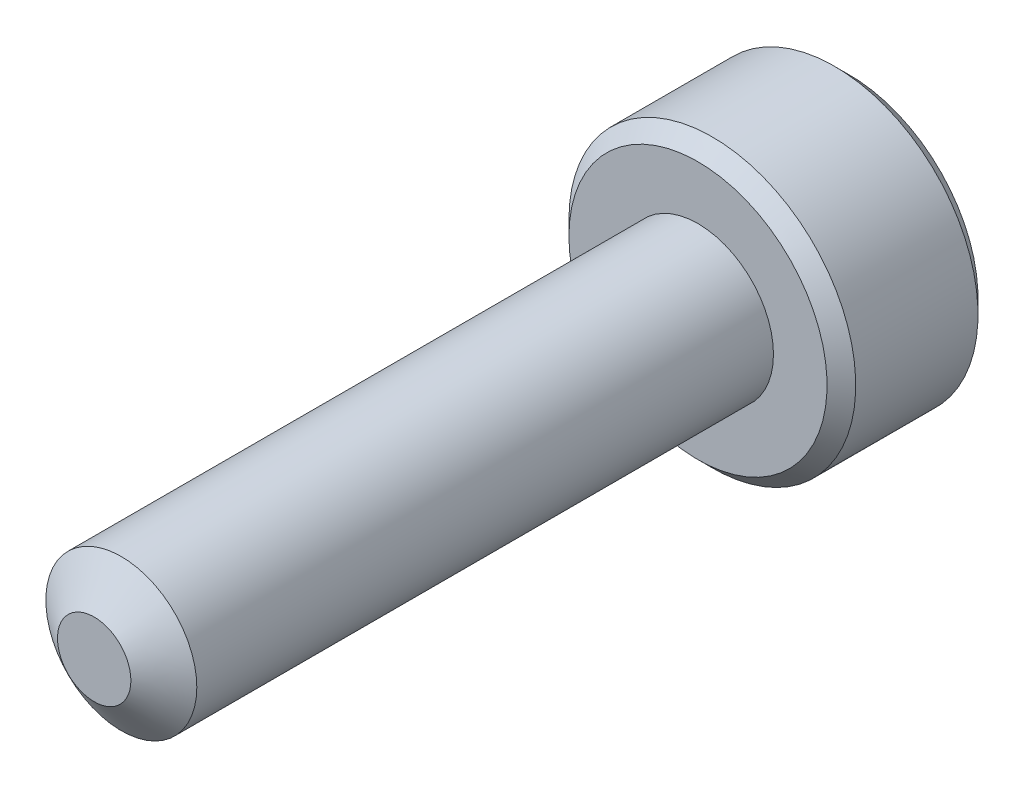
ISO-10303-21;
HEADER;
FILE_DESCRIPTION(('STEP AP214'),'2;1');
FILE_NAME('part.step','',(''),(''),'','','');
FILE_SCHEMA(('AUTOMOTIVE_DESIGN { 1 0 10303 214 1 1 1 1 }'));
ENDSEC;
DATA;
#1=APPLICATION_CONTEXT('core data for automotive mechanical design processes');
#2=APPLICATION_PROTOCOL_DEFINITION('international standard','automotive_design',2000,#1);
#3=PRODUCT_CONTEXT('',#1,'mechanical');
#4=PRODUCT('Part','Part','',(#3));
#5=PRODUCT_RELATED_PRODUCT_CATEGORY('part','',(#4));
#6=PRODUCT_DEFINITION_FORMATION('','',#4);
#7=PRODUCT_DEFINITION_CONTEXT('part definition',#1,'design');
#8=PRODUCT_DEFINITION('design','',#6,#7);
#9=PRODUCT_DEFINITION_SHAPE('','',#8);
#10=(LENGTH_UNIT() NAMED_UNIT(*) SI_UNIT(.MILLI.,.METRE.));
#11=(NAMED_UNIT(*) PLANE_ANGLE_UNIT() SI_UNIT($,.RADIAN.));
#12=(NAMED_UNIT(*) SI_UNIT($,.STERADIAN.) SOLID_ANGLE_UNIT());
#13=UNCERTAINTY_MEASURE_WITH_UNIT(LENGTH_MEASURE(1.E-05),#10,'distance_accuracy_value','');
#14=(GEOMETRIC_REPRESENTATION_CONTEXT(3) GLOBAL_UNCERTAINTY_ASSIGNED_CONTEXT((#13)) GLOBAL_UNIT_ASSIGNED_CONTEXT((#10,
#11,#12)) REPRESENTATION_CONTEXT('',''));
#15=CARTESIAN_POINT('',(0.,0.,0.));
#16=DIRECTION('',(0.,0.,1.));
#17=DIRECTION('',(1.,0.,0.));
#18=AXIS2_PLACEMENT_3D('',#15,#16,#17);
#19=CARTESIAN_POINT('',(0.,0.,-8.));
#20=DIRECTION('',(0.,0.,1.));
#21=DIRECTION('',(1.,0.,0.));
#22=AXIS2_PLACEMENT_3D('',#19,#20,#21);
#23=CYLINDRICAL_SURFACE('',#22,1.);
#24=CARTESIAN_POINT('',(0.,0.,-8.));
#25=DIRECTION('',(0.,0.,-1.));
#26=DIRECTION('',(-1.,0.,0.));
#27=AXIS2_PLACEMENT_3D('',#24,#25,#26);
#28=CIRCLE('',#27,1.);
#29=CARTESIAN_POINT('',(-1.,0.,-8.));
#30=VERTEX_POINT('',#29);
#31=EDGE_CURVE('E210',#30,#30,#28,.F.);
#32=ORIENTED_EDGE('',*,*,#31,.T.);
#33=EDGE_LOOP('',(#32));
#34=FACE_BOUND('',#33,.T.);
#35=CARTESIAN_POINT('',(0.,0.,-0.359771969508557));
#36=DIRECTION('',(0.,0.,1.));
#37=DIRECTION('',(1.,0.,0.));
#38=AXIS2_PLACEMENT_3D('',#35,#36,#37);
#39=CIRCLE('',#38,1.);
#40=CARTESIAN_POINT('',(1.,0.,-0.359771969508557));
#41=VERTEX_POINT('',#40);
#42=EDGE_CURVE('E107',#41,#41,#39,.T.);
#43=ORIENTED_EDGE('',*,*,#42,.F.);
#44=EDGE_LOOP('',(#43));
#45=FACE_BOUND('',#44,.T.);
#46=ADVANCED_FACE('F33',(#34,#45),#23,.T.);
#47=CARTESIAN_POINT('',(0.,0.,0.));
#48=DIRECTION('',(0.,0.,-1.));
#49=DIRECTION('',(-1.,0.,0.));
#50=AXIS2_PLACEMENT_3D('',#47,#48,#49);
#51=CONICAL_SURFACE('',#50,0.486192378864667,0.959931088596884);
#52=ORIENTED_EDGE('',*,*,#42,.T.);
#53=EDGE_LOOP('',(#52));
#54=FACE_BOUND('',#53,.T.);
#55=CARTESIAN_POINT('',(0.,0.,0.));
#56=DIRECTION('',(0.,0.,1.));
#57=DIRECTION('',(1.,0.,0.));
#58=AXIS2_PLACEMENT_3D('',#55,#56,#57);
#59=CIRCLE('',#58,0.486192378864667);
#60=CARTESIAN_POINT('',(0.486192378864667,0.,0.));
#61=VERTEX_POINT('',#60);
#62=EDGE_CURVE('E208',#61,#61,#59,.T.);
#63=ORIENTED_EDGE('',*,*,#62,.F.);
#64=EDGE_LOOP('',(#63));
#65=FACE_BOUND('',#64,.T.);
#66=ADVANCED_FACE('F191',(#54,#65),#51,.T.);
#67=CARTESIAN_POINT('',(0.,0.,0.));
#68=DIRECTION('',(0.,0.,1.));
#69=DIRECTION('',(1.,0.,0.));
#70=AXIS2_PLACEMENT_3D('',#67,#68,#69);
#71=PLANE('',#70);
#72=ORIENTED_EDGE('',*,*,#62,.T.);
#73=EDGE_LOOP('',(#72));
#74=FACE_BOUND('',#73,.T.);
#75=ADVANCED_FACE('F188',(#74),#71,.T.);
#76=CARTESIAN_POINT('',(0.,0.,-10.));
#77=DIRECTION('',(0.,0.,1.));
#78=DIRECTION('',(1.,0.,0.));
#79=AXIS2_PLACEMENT_3D('',#76,#77,#78);
#80=CYLINDRICAL_SURFACE('',#79,1.9);
#81=CARTESIAN_POINT('',(0.,0.,-9.81));
#82=DIRECTION('',(0.,0.,-1.));
#83=DIRECTION('',(-1.,0.,0.));
#84=AXIS2_PLACEMENT_3D('',#81,#82,#83);
#85=CIRCLE('',#84,1.9);
#86=CARTESIAN_POINT('',(-1.9,0.,-9.81));
#87=VERTEX_POINT('',#86);
#88=EDGE_CURVE('E41',#87,#87,#85,.F.);
#89=ORIENTED_EDGE('',*,*,#88,.T.);
#90=EDGE_LOOP('',(#89));
#91=FACE_BOUND('',#90,.T.);
#92=CARTESIAN_POINT('',(0.,0.,-8.19));
#93=DIRECTION('',(0.,0.,-1.));
#94=DIRECTION('',(-1.,0.,0.));
#95=AXIS2_PLACEMENT_3D('',#92,#93,#94);
#96=CIRCLE('',#95,1.9);
#97=CARTESIAN_POINT('',(-1.9,0.,-8.19));
#98=VERTEX_POINT('',#97);
#99=EDGE_CURVE('E167',#98,#98,#96,.T.);
#100=ORIENTED_EDGE('',*,*,#99,.T.);
#101=EDGE_LOOP('',(#100));
#102=FACE_BOUND('',#101,.T.);
#103=ADVANCED_FACE('F172',(#91,#102),#80,.T.);
#104=CARTESIAN_POINT('',(0.,0.,-10.));
#105=DIRECTION('',(0.,0.,-1.));
#106=DIRECTION('',(-1.,0.,0.));
#107=AXIS2_PLACEMENT_3D('',#104,#105,#106);
#108=PLANE('',#107);
#109=CARTESIAN_POINT('',(0.,0.,-10.));
#110=DIRECTION('',(0.,0.,-1.));
#111=DIRECTION('',(-1.,0.,0.));
#112=AXIS2_PLACEMENT_3D('',#109,#110,#111);
#113=CIRCLE('',#112,1.71);
#114=CARTESIAN_POINT('',(-1.71,0.,-10.));
#115=VERTEX_POINT('',#114);
#116=EDGE_CURVE('E106',#115,#115,#113,.T.);
#117=ORIENTED_EDGE('',*,*,#116,.T.);
#118=EDGE_LOOP('',(#117));
#119=FACE_BOUND('',#118,.T.);
#120=CARTESIAN_POINT('',(0.,0.,-10.));
#121=DIRECTION('',(0.,0.,-1.));
#122=DIRECTION('',(-1.,0.,0.));
#123=AXIS2_PLACEMENT_3D('',#120,#121,#122);
#124=CIRCLE('',#123,0.866025403784438);
#125=CARTESIAN_POINT('',(-0.749999999999999,0.43301270189222,-10.));
#126=VERTEX_POINT('',#125);
#127=CARTESIAN_POINT('',(0.,0.866025403784438,-10.));
#128=VERTEX_POINT('',#127);
#129=EDGE_CURVE('E87',#126,#128,#124,.T.);
#130=ORIENTED_EDGE('',*,*,#129,.F.);
#131=CARTESIAN_POINT('',(-0.749999999999999,-0.43301270189222,-10.));
#132=VERTEX_POINT('',#131);
#133=EDGE_CURVE('E47',#132,#126,#124,.T.);
#134=ORIENTED_EDGE('',*,*,#133,.F.);
#135=CARTESIAN_POINT('',(0.,-0.866025403784438,-10.));
#136=VERTEX_POINT('',#135);
#137=EDGE_CURVE('E266',#136,#132,#124,.T.);
#138=ORIENTED_EDGE('',*,*,#137,.F.);
#139=CARTESIAN_POINT('',(0.75,-0.433012701892219,-10.));
#140=VERTEX_POINT('',#139);
#141=EDGE_CURVE('E54',#140,#136,#124,.T.);
#142=ORIENTED_EDGE('',*,*,#141,.F.);
#143=CARTESIAN_POINT('',(0.749999999999999,0.43301270189222,-10.));
#144=VERTEX_POINT('',#143);
#145=EDGE_CURVE('E128',#144,#140,#124,.T.);
#146=ORIENTED_EDGE('',*,*,#145,.F.);
#147=EDGE_CURVE('E96',#128,#144,#124,.T.);
#148=ORIENTED_EDGE('',*,*,#147,.F.);
#149=EDGE_LOOP('',(#130,#134,#138,#142,#146,#148));
#150=FACE_BOUND('',#149,.T.);
#151=ADVANCED_FACE('F127',(#119,#150),#108,.T.);
#152=CARTESIAN_POINT('',(0.,0.,-8.));
#153=DIRECTION('',(0.,0.,-1.));
#154=DIRECTION('',(-1.,0.,0.));
#155=AXIS2_PLACEMENT_3D('',#152,#153,#154);
#156=PLANE('',#155);
#157=CARTESIAN_POINT('',(0.,0.,-8.));
#158=DIRECTION('',(0.,0.,-1.));
#159=DIRECTION('',(-1.,0.,0.));
#160=AXIS2_PLACEMENT_3D('',#157,#158,#159);
#161=CIRCLE('',#160,1.71);
#162=CARTESIAN_POINT('',(-1.71,0.,-8.));
#163=VERTEX_POINT('',#162);
#164=EDGE_CURVE('E11',#163,#163,#161,.F.);
#165=ORIENTED_EDGE('',*,*,#164,.T.);
#166=EDGE_LOOP('',(#165));
#167=FACE_BOUND('',#166,.T.);
#168=ORIENTED_EDGE('',*,*,#31,.F.);
#169=EDGE_LOOP('',(#168));
#170=FACE_BOUND('',#169,.T.);
#171=ADVANCED_FACE('F181',(#167,#170),#156,.F.);
#172=CARTESIAN_POINT('',(0.,0.,-10.));
#173=DIRECTION('',(0.,0.,-1.));
#174=DIRECTION('',(-1.,0.,0.));
#175=AXIS2_PLACEMENT_3D('',#172,#173,#174);
#176=CONICAL_SURFACE('',#175,0.866025403784438,0.78539816339745);
#177=ORIENTED_EDGE('',*,*,#147,.T.);
#178=CARTESIAN_POINT('',(-0.000199999999999593,0.866140873838276,-10.0001154931448));
#179=CARTESIAN_POINT('',(0.025589962557682,0.851251032013208,-9.98523411046392));
#180=CARTESIAN_POINT('',(0.0518112021286597,0.836112192288419,-9.97122626560696));
#181=CARTESIAN_POINT('',(0.105279708235707,0.805242135894348,-9.94557752468226));
#182=CARTESIAN_POINT('',(0.132532067460573,0.789507978959819,-9.93395091170567));
#183=CARTESIAN_POINT('',(0.187485350381353,0.757780686272653,-9.91403404577224));
#184=CARTESIAN_POINT('',(0.21517225669551,0.741795643459147,-9.90569369408137));
#185=CARTESIAN_POINT('',(0.271155595130853,0.709473647943367,-9.89284274196143));
#186=CARTESIAN_POINT('',(0.299450314843645,0.693137683900542,-9.88832254058884));
#187=CARTESIAN_POINT('',(0.348210289268843,0.664986099540475,-9.88424583309744));
#188=CARTESIAN_POINT('',(0.368612065655572,0.65320712845165,-9.88364279661408));
#189=CARTESIAN_POINT('',(0.40937613469636,0.629671982217687,-9.88465450601553));
#190=CARTESIAN_POINT('',(0.429738417651455,0.617915812672247,-9.88626974099003));
#191=CARTESIAN_POINT('',(0.490534543086824,0.582815153286451,-9.89433614697304));
#192=CARTESIAN_POINT('',(0.530665854996099,0.559645329552698,-9.90400893582772));
#193=CARTESIAN_POINT('',(0.601110400354026,0.518974152327358,-9.92735631797231));
#194=CARTESIAN_POINT('',(0.631753572009086,0.501282308923485,-9.93980855807225));
#195=CARTESIAN_POINT('',(0.691839345804789,0.466591771248069,-9.96785961023086));
#196=CARTESIAN_POINT('',(0.72128548838159,0.449591032904757,-9.98344818590375));
#197=CARTESIAN_POINT('',(0.7502,0.432897231838382,-10.0001154931448));
#198=B_SPLINE_CURVE_WITH_KNOTS('',3,(#178,#179,#180,#181,#182,#183,#184,#185,#186,#187,#188,
#189,#190,#191,#192,#193,#194,#195,#196,#197),.UNSPECIFIED.,.F.,.F.,(4,2,2,2,2,2,2,2,2,4),(0.,
0.0999419466095601,0.200466857654446,0.299393763705717,0.39807129730023,0.468665775681747,
0.539275821398839,0.680536257244566,0.792918418368073,0.904939568716031),.UNSPECIFIED.);
#199=EDGE_CURVE('E101',#128,#144,#198,.T.);
#200=ORIENTED_EDGE('',*,*,#199,.F.);
#201=EDGE_LOOP('',(#177,#200));
#202=FACE_BOUND('',#201,.T.);
#203=ADVANCED_FACE('F102',(#202),#176,.F.);
#204=ORIENTED_EDGE('',*,*,#145,.T.);
#205=CARTESIAN_POINT('',(0.75,-0.863604064974112,-10.2777892582303));
#206=CARTESIAN_POINT('',(0.75,-0.842575879856458,-10.2619149320996));
#207=CARTESIAN_POINT('',(0.75,-0.82143049641015,-10.2461962652706));
#208=CARTESIAN_POINT('',(0.75,-0.7788578575305,-10.2151345207069));
#209=CARTESIAN_POINT('',(0.75,-0.757430533150144,-10.1997915375702));
#210=CARTESIAN_POINT('',(0.75,-0.69234071080991,-10.1542035803594));
#211=CARTESIAN_POINT('',(0.75,-0.648190081142954,-10.1246440918019));
#212=CARTESIAN_POINT('',(0.75,-0.555607181575076,-10.0666155827363));
#213=CARTESIAN_POINT('',(0.75,-0.507074363082498,-10.0383051094017));
#214=CARTESIAN_POINT('',(0.75,-0.407587529818442,-9.98651811179061));
#215=CARTESIAN_POINT('',(0.75,-0.356642419585008,-9.96302529154705));
#216=CARTESIAN_POINT('',(0.75,-0.280165468850111,-9.93428689951103));
#217=CARTESIAN_POINT('',(0.75,-0.255770023962927,-9.9260392748236));
#218=CARTESIAN_POINT('',(0.75,-0.206403277923611,-9.91149717543051));
#219=CARTESIAN_POINT('',(0.75,-0.181431937227496,-9.90520283527902));
#220=CARTESIAN_POINT('',(0.75,-0.10669987945563,-9.88999317388815));
#221=CARTESIAN_POINT('',(0.75,-0.0561907172329782,-9.88437718471751));
#222=CARTESIAN_POINT('',(0.75,0.0430767231074191,-9.88362825645083));
#223=CARTESIAN_POINT('',(0.75,0.0918322433444378,-9.88812345139702));
#224=CARTESIAN_POINT('',(0.75,0.164112195619626,-9.90133730742922));
#225=CARTESIAN_POINT('',(0.75,0.188278676798617,-9.90690144636243));
#226=CARTESIAN_POINT('',(0.75,0.236094480035413,-9.91992316612325));
#227=CARTESIAN_POINT('',(0.75,0.259743845186176,-9.92738058851924));
#228=CARTESIAN_POINT('',(0.75,0.334198278358037,-9.95366646942379));
#229=CARTESIAN_POINT('',(0.75,0.383940060323694,-9.97549033799338));
#230=CARTESIAN_POINT('',(0.75,0.481089224924055,-10.0240118040186));
#231=CARTESIAN_POINT('',(0.75,0.528487417805623,-10.0507269112141));
#232=CARTESIAN_POINT('',(0.75,0.619071540271279,-10.1058428510274));
#233=CARTESIAN_POINT('',(0.75,0.662349745094377,-10.134093945316));
#234=CARTESIAN_POINT('',(0.75,0.726111622992782,-10.1777671469421));
#235=CARTESIAN_POINT('',(0.75,0.747090419026061,-10.1924788603549));
#236=CARTESIAN_POINT('',(0.75,0.788761341261127,-10.222291383928));
#237=CARTESIAN_POINT('',(0.75,0.809453544289149,-10.2373920865822));
#238=CARTESIAN_POINT('',(0.75,0.830026389845271,-10.2526540891176));
#239=B_SPLINE_CURVE_WITH_KNOTS('',3,(#205,#206,#207,#208,#209,#210,#211,#212,#213,#214,#215,
#216,#217,#218,#219,#220,#221,#222,#223,#224,#225,#226,#227,#228,#229,#230,#231,#232,#233,#234,
#235,#236,#237,#238),.UNSPECIFIED.,.F.,.F.,(4,2,2,2,2,2,2,2,2,2,2,2,2,2,2,2,4),(0.,
0.0790398443275114,0.158099390527685,0.317425208734853,0.485845155776513,0.653685658433149,
0.73086980575654,0.808059268815782,0.959469653475935,1.1054029045548,1.1797320311882,
1.25405493994416,1.41653726506484,1.57961304282019,1.73458511685198,1.81145152919337,
1.88829692100168),.UNSPECIFIED.);
#240=EDGE_CURVE('E95',#144,#140,#239,.F.);
#241=ORIENTED_EDGE('',*,*,#240,.F.);
#242=EDGE_LOOP('',(#204,#241));
#243=FACE_BOUND('',#242,.T.);
#244=ADVANCED_FACE('F272',(#243),#176,.F.);
#245=ORIENTED_EDGE('',*,*,#141,.T.);
#246=CARTESIAN_POINT('',(0.7502,-0.432897231838382,-10.0001154931448));
#247=CARTESIAN_POINT('',(0.724410037442318,-0.44778707366345,-9.98523411046392));
#248=CARTESIAN_POINT('',(0.69818879787134,-0.462925913388239,-9.97122626560696));
#249=CARTESIAN_POINT('',(0.644720291764293,-0.49379596978231,-9.94557752468226));
#250=CARTESIAN_POINT('',(0.617467932539427,-0.509530126716839,-9.93395091170567));
#251=CARTESIAN_POINT('',(0.562514649618646,-0.541257419404005,-9.91403404577224));
#252=CARTESIAN_POINT('',(0.53482774330449,-0.557242462217512,-9.90569369408137));
#253=CARTESIAN_POINT('',(0.478844404869146,-0.589564457733291,-9.89284274196143));
#254=CARTESIAN_POINT('',(0.450549685156354,-0.605900421776116,-9.88832254058884));
#255=CARTESIAN_POINT('',(0.401789710731156,-0.634052006136184,-9.88424583309744));
#256=CARTESIAN_POINT('',(0.381387934344427,-0.645830977225009,-9.88364279661408));
#257=CARTESIAN_POINT('',(0.340623865303639,-0.669366123458972,-9.88465450601553));
#258=CARTESIAN_POINT('',(0.320261582348544,-0.681122293004411,-9.88626974099003));
#259=CARTESIAN_POINT('',(0.259465456913175,-0.716222952390208,-9.89433614697304));
#260=CARTESIAN_POINT('',(0.2193341450039,-0.73939277612396,-9.90400893582772));
#261=CARTESIAN_POINT('',(0.148889599645974,-0.7800639533493,-9.92735631797231));
#262=CARTESIAN_POINT('',(0.118246427990913,-0.797755796753173,-9.93980855807225));
#263=CARTESIAN_POINT('',(0.0581606541952102,-0.83244633442859,-9.96785961023086));
#264=CARTESIAN_POINT('',(0.0287145116184093,-0.849447072771901,-9.98344818590375));
#265=CARTESIAN_POINT('',(-0.000199999999999743,-0.866140873838276,-10.0001154931448));
#266=B_SPLINE_CURVE_WITH_KNOTS('',3,(#246,#247,#248,#249,#250,#251,#252,#253,#254,#255,#256,
#257,#258,#259,#260,#261,#262,#263,#264,#265),.UNSPECIFIED.,.F.,.F.,(4,2,2,2,2,2,2,2,2,4),(0.,
0.0999419466095608,0.200466857654447,0.299393763705718,0.398071297300231,0.468665775681748,
0.53927582139884,0.680536257244567,0.792918418368074,0.904939568716032),.UNSPECIFIED.);
#267=EDGE_CURVE('E137',#140,#136,#266,.T.);
#268=ORIENTED_EDGE('',*,*,#267,.F.);
#269=EDGE_LOOP('',(#245,#268));
#270=FACE_BOUND('',#269,.T.);
#271=ADVANCED_FACE('F269',(#270),#176,.F.);
#272=ORIENTED_EDGE('',*,*,#137,.T.);
#273=CARTESIAN_POINT('',(0.000200000000000017,-0.866140873838277,-10.0001154931448));
#274=CARTESIAN_POINT('',(-0.0255899625576813,-0.851251032013209,-9.98523411046392));
#275=CARTESIAN_POINT('',(-0.0518112021286592,-0.836112192288419,-9.97122626560696));
#276=CARTESIAN_POINT('',(-0.105279708235707,-0.805242135894348,-9.94557752468226));
#277=CARTESIAN_POINT('',(-0.132532067460573,-0.789507978959819,-9.93395091170567));
#278=CARTESIAN_POINT('',(-0.187485350381353,-0.757780686272653,-9.91403404577225));
#279=CARTESIAN_POINT('',(-0.21517225669551,-0.741795643459147,-9.90569369408137));
#280=CARTESIAN_POINT('',(-0.271155595130853,-0.709473647943367,-9.89284274196143));
#281=CARTESIAN_POINT('',(-0.299450314843645,-0.693137683900542,-9.88832254058884));
#282=CARTESIAN_POINT('',(-0.348210289268844,-0.664986099540474,-9.88424583309744));
#283=CARTESIAN_POINT('',(-0.368612065655573,-0.65320712845165,-9.88364279661408));
#284=CARTESIAN_POINT('',(-0.409376134696361,-0.629671982217687,-9.88465450601553));
#285=CARTESIAN_POINT('',(-0.429738417651456,-0.617915812672247,-9.88626974099003));
#286=CARTESIAN_POINT('',(-0.490534543086824,-0.582815153286451,-9.89433614697304));
#287=CARTESIAN_POINT('',(-0.5306658549961,-0.559645329552698,-9.90400893582772));
#288=CARTESIAN_POINT('',(-0.601110400354026,-0.518974152327358,-9.92735631797231));
#289=CARTESIAN_POINT('',(-0.631753572009087,-0.501282308923485,-9.93980855807225));
#290=CARTESIAN_POINT('',(-0.69183934580479,-0.466591771248069,-9.96785961023086));
#291=CARTESIAN_POINT('',(-0.72128548838159,-0.449591032904757,-9.98344818590375));
#292=CARTESIAN_POINT('',(-0.750199999999999,-0.432897231838382,-10.0001154931448));
#293=B_SPLINE_CURVE_WITH_KNOTS('',3,(#273,#274,#275,#276,#277,#278,#279,#280,#281,#282,#283,
#284,#285,#286,#287,#288,#289,#290,#291,#292),.UNSPECIFIED.,.F.,.F.,(4,2,2,2,2,2,2,2,2,4),(0.,
0.0999419466095603,0.200466857654446,0.299393763705717,0.398071297300231,0.468665775681748,
0.53927582139884,0.680536257244567,0.792918418368073,0.904939568716031),.UNSPECIFIED.);
#294=EDGE_CURVE('E244',#136,#132,#293,.T.);
#295=ORIENTED_EDGE('',*,*,#294,.F.);
#296=EDGE_LOOP('',(#272,#295));
#297=FACE_BOUND('',#296,.T.);
#298=ADVANCED_FACE('F268',(#297),#176,.F.);
#299=ORIENTED_EDGE('',*,*,#133,.T.);
#300=CARTESIAN_POINT('',(-0.749999999999999,-0.863604064974114,-10.2777892582303));
#301=CARTESIAN_POINT('',(-0.749999999999999,-0.842575879856459,-10.2619149320996));
#302=CARTESIAN_POINT('',(-0.749999999999999,-0.82143049641015,-10.2461962652706));
#303=CARTESIAN_POINT('',(-0.749999999999999,-0.7788578575305,-10.2151345207069));
#304=CARTESIAN_POINT('',(-0.749999999999999,-0.757430533150144,-10.1997915375702));
#305=CARTESIAN_POINT('',(-0.749999999999999,-0.692340710809911,-10.1542035803594));
#306=CARTESIAN_POINT('',(-0.749999999999999,-0.648190081142953,-10.1246440918019));
#307=CARTESIAN_POINT('',(-0.749999999999999,-0.555607181575074,-10.0666155827363));
#308=CARTESIAN_POINT('',(-0.749999999999999,-0.507074363082497,-10.0383051094017));
#309=CARTESIAN_POINT('',(-0.749999999999999,-0.407587529818441,-9.98651811179061));
#310=CARTESIAN_POINT('',(-0.749999999999999,-0.356642419585009,-9.96302529154705));
#311=CARTESIAN_POINT('',(-0.749999999999999,-0.280165468850111,-9.93428689951103));
#312=CARTESIAN_POINT('',(-0.749999999999999,-0.255770023962927,-9.9260392748236));
#313=CARTESIAN_POINT('',(-0.749999999999999,-0.206403277923611,-9.91149717543051));
#314=CARTESIAN_POINT('',(-0.749999999999999,-0.181431937227496,-9.90520283527902));
#315=CARTESIAN_POINT('',(-0.749999999999999,-0.10669987945563,-9.88999317388815));
#316=CARTESIAN_POINT('',(-0.749999999999999,-0.056190717232978,-9.88437718471751));
#317=CARTESIAN_POINT('',(-0.749999999999999,0.0430767231074187,-9.88362825645083));
#318=CARTESIAN_POINT('',(-0.749999999999999,0.0918322433444369,-9.88812345139703));
#319=CARTESIAN_POINT('',(-0.749999999999999,0.164112195619625,-9.90133730742922));
#320=CARTESIAN_POINT('',(-0.749999999999999,0.188278676798616,-9.90690144636243));
#321=CARTESIAN_POINT('',(-0.749999999999999,0.236094480035413,-9.91992316612325));
#322=CARTESIAN_POINT('',(-0.749999999999999,0.259743845186175,-9.92738058851924));
#323=CARTESIAN_POINT('',(-0.749999999999999,0.334198278358036,-9.95366646942379));
#324=CARTESIAN_POINT('',(-0.749999999999999,0.383940060323692,-9.97549033799337));
#325=CARTESIAN_POINT('',(-0.749999999999999,0.481089224924053,-10.0240118040186));
#326=CARTESIAN_POINT('',(-0.749999999999999,0.52848741780562,-10.0507269112141));
#327=CARTESIAN_POINT('',(-0.749999999999999,0.619071540271276,-10.1058428510274));
#328=CARTESIAN_POINT('',(-0.749999999999999,0.662349745094374,-10.134093945316));
#329=CARTESIAN_POINT('',(-0.749999999999999,0.726111622992779,-10.1777671469421));
#330=CARTESIAN_POINT('',(-0.749999999999999,0.747090419026059,-10.1924788603549));
#331=CARTESIAN_POINT('',(-0.749999999999999,0.788761341261125,-10.2222913839279));
#332=CARTESIAN_POINT('',(-0.749999999999999,0.809453544289146,-10.2373920865822));
#333=CARTESIAN_POINT('',(-0.749999999999999,0.830026389845267,-10.2526540891176));
#334=B_SPLINE_CURVE_WITH_KNOTS('',3,(#300,#301,#302,#303,#304,#305,#306,#307,#308,#309,#310,
#311,#312,#313,#314,#315,#316,#317,#318,#319,#320,#321,#322,#323,#324,#325,#326,#327,#328,#329,
#330,#331,#332,#333),.UNSPECIFIED.,.F.,.F.,(4,2,2,2,2,2,2,2,2,2,2,2,2,2,2,2,4),(0.,
0.0790398443275135,0.158099390527688,0.317425208734856,0.485845155776516,0.65368565843315,
0.730869805756542,0.808059268815785,0.959469653475937,1.1054029045548,1.17973203118821,
1.25405493994416,1.41653726506484,1.57961304282019,1.73458511685198,1.81145152919337,
1.88829692100168),.UNSPECIFIED.);
#335=EDGE_CURVE('E117',#132,#126,#334,.T.);
#336=ORIENTED_EDGE('',*,*,#335,.F.);
#337=EDGE_LOOP('',(#299,#336));
#338=FACE_BOUND('',#337,.T.);
#339=ADVANCED_FACE('F281',(#338),#176,.F.);
#340=ORIENTED_EDGE('',*,*,#129,.T.);
#341=CARTESIAN_POINT('',(-0.7502,0.432897231838381,-10.0001154931448));
#342=CARTESIAN_POINT('',(-0.724410037442318,0.447787073663449,-9.98523411046392));
#343=CARTESIAN_POINT('',(-0.69818879787134,0.462925913388239,-9.97122626560696));
#344=CARTESIAN_POINT('',(-0.644720291764293,0.49379596978231,-9.94557752468226));
#345=CARTESIAN_POINT('',(-0.617467932539427,0.509530126716839,-9.93395091170567));
#346=CARTESIAN_POINT('',(-0.562514649618647,0.541257419404005,-9.91403404577224));
#347=CARTESIAN_POINT('',(-0.53482774330449,0.557242462217511,-9.90569369408137));
#348=CARTESIAN_POINT('',(-0.478844404869147,0.58956445773329,-9.89284274196143));
#349=CARTESIAN_POINT('',(-0.450549685156355,0.605900421776116,-9.88832254058884));
#350=CARTESIAN_POINT('',(-0.401789710731157,0.634052006136183,-9.88424583309743));
#351=CARTESIAN_POINT('',(-0.381387934344427,0.645830977225008,-9.88364279661408));
#352=CARTESIAN_POINT('',(-0.34062386530364,0.669366123458971,-9.88465450601553));
#353=CARTESIAN_POINT('',(-0.320261582348545,0.681122293004411,-9.88626974099003));
#354=CARTESIAN_POINT('',(-0.259465456913176,0.716222952390207,-9.89433614697304));
#355=CARTESIAN_POINT('',(-0.219334145003901,0.739392776123959,-9.90400893582772));
#356=CARTESIAN_POINT('',(-0.148889599645974,0.780063953349299,-9.92735631797231));
#357=CARTESIAN_POINT('',(-0.118246427990913,0.797755796753173,-9.93980855807225));
#358=CARTESIAN_POINT('',(-0.0581606541952096,0.832446334428589,-9.96785961023086));
#359=CARTESIAN_POINT('',(-0.0287145116184087,0.849447072771901,-9.98344818590375));
#360=CARTESIAN_POINT('',(0.000200000000000486,0.866140873838276,-10.0001154931448));
#361=B_SPLINE_CURVE_WITH_KNOTS('',3,(#341,#342,#343,#344,#345,#346,#347,#348,#349,#350,#351,
#352,#353,#354,#355,#356,#357,#358,#359,#360),.UNSPECIFIED.,.F.,.F.,(4,2,2,2,2,2,2,2,2,4),(0.,
0.0999419466095602,0.200466857654446,0.299393763705718,0.39807129730023,0.468665775681748,
0.53927582139884,0.680536257244566,0.792918418368074,0.904939568716032),.UNSPECIFIED.);
#362=EDGE_CURVE('E91',#126,#128,#361,.T.);
#363=ORIENTED_EDGE('',*,*,#362,.F.);
#364=EDGE_LOOP('',(#340,#363));
#365=FACE_BOUND('',#364,.T.);
#366=ADVANCED_FACE('F89',(#365),#176,.F.);
#367=CARTESIAN_POINT('',(0.749999999999999,1.29903810567666,-8.875));
#368=DIRECTION('',(0.,0.,-1.));
#369=DIRECTION('',(-1.,0.,0.));
#370=AXIS2_PLACEMENT_3D('',#367,#368,#369);
#371=PLANE('',#370);
#372=DIRECTION('',(0.866025403784439,0.5,0.));
#373=VECTOR('',#372,1.);
#374=CARTESIAN_POINT('',(-0.749999999999999,0.433012701892219,-8.875));
#375=LINE('',#374,#373);
#376=CARTESIAN_POINT('',(-0.749999999999999,0.433012701892219,-8.875));
#377=VERTEX_POINT('',#376);
#378=CARTESIAN_POINT('',(0.,0.866025403784438,-8.875));
#379=VERTEX_POINT('',#378);
#380=EDGE_CURVE('E116',#377,#379,#375,.T.);
#381=ORIENTED_EDGE('',*,*,#380,.T.);
#382=DIRECTION('',(0.866025403784439,-0.5,0.));
#383=VECTOR('',#382,1.);
#384=CARTESIAN_POINT('',(0.,0.866025403784438,-8.875));
#385=LINE('',#384,#383);
#386=CARTESIAN_POINT('',(0.75,0.43301270189222,-8.875));
#387=VERTEX_POINT('',#386);
#388=EDGE_CURVE('E121',#379,#387,#385,.T.);
#389=ORIENTED_EDGE('',*,*,#388,.T.);
#390=DIRECTION('',(0.,-1.,0.));
#391=VECTOR('',#390,1.);
#392=CARTESIAN_POINT('',(0.75,0.43301270189222,-8.875));
#393=LINE('',#392,#391);
#394=CARTESIAN_POINT('',(0.75,-0.43301270189222,-8.875));
#395=VERTEX_POINT('',#394);
#396=EDGE_CURVE('E232',#387,#395,#393,.T.);
#397=ORIENTED_EDGE('',*,*,#396,.T.);
#398=DIRECTION('',(-0.866025403784439,-0.5,0.));
#399=VECTOR('',#398,1.);
#400=CARTESIAN_POINT('',(0.75,-0.43301270189222,-8.875));
#401=LINE('',#400,#399);
#402=CARTESIAN_POINT('',(0.,-0.866025403784439,-8.875));
#403=VERTEX_POINT('',#402);
#404=EDGE_CURVE('E229',#395,#403,#401,.T.);
#405=ORIENTED_EDGE('',*,*,#404,.T.);
#406=DIRECTION('',(-0.866025403784439,0.5,0.));
#407=VECTOR('',#406,1.);
#408=CARTESIAN_POINT('',(0.,-0.866025403784439,-8.875));
#409=LINE('',#408,#407);
#410=CARTESIAN_POINT('',(-0.749999999999999,-0.43301270189222,-8.875));
#411=VERTEX_POINT('',#410);
#412=EDGE_CURVE('E226',#403,#411,#409,.T.);
#413=ORIENTED_EDGE('',*,*,#412,.T.);
#414=DIRECTION('',(0.,1.,0.));
#415=VECTOR('',#414,1.);
#416=CARTESIAN_POINT('',(-0.749999999999999,-0.43301270189222,-8.875));
#417=LINE('',#416,#415);
#418=EDGE_CURVE('E124',#411,#377,#417,.T.);
#419=ORIENTED_EDGE('',*,*,#418,.T.);
#420=EDGE_LOOP('',(#381,#389,#397,#405,#413,#419));
#421=FACE_BOUND('',#420,.T.);
#422=ADVANCED_FACE('F156',(#421),#371,.T.);
#423=CARTESIAN_POINT('',(0.,0.866025403784438,-8.875));
#424=DIRECTION('',(0.5,0.866025403784439,0.));
#425=DIRECTION('',(-0.866025403784439,0.5,0.));
#426=AXIS2_PLACEMENT_3D('',#423,#424,#425);
#427=PLANE('',#426);
#428=DIRECTION('',(0.,0.,-1.));
#429=VECTOR('',#428,1.);
#430=CARTESIAN_POINT('',(0.,0.866025403784438,-8.875));
#431=LINE('',#430,#429);
#432=EDGE_CURVE('E113',#379,#128,#431,.T.);
#433=ORIENTED_EDGE('',*,*,#432,.T.);
#434=ORIENTED_EDGE('',*,*,#199,.T.);
#435=DIRECTION('',(0.,0.,-1.));
#436=VECTOR('',#435,1.);
#437=CARTESIAN_POINT('',(0.75,0.43301270189222,-8.875));
#438=LINE('',#437,#436);
#439=EDGE_CURVE('E123',#387,#144,#438,.T.);
#440=ORIENTED_EDGE('',*,*,#439,.F.);
#441=ORIENTED_EDGE('',*,*,#388,.F.);
#442=EDGE_LOOP('',(#433,#434,#440,#441));
#443=FACE_BOUND('',#442,.T.);
#444=ADVANCED_FACE('F119',(#443),#427,.F.);
#445=CARTESIAN_POINT('',(0.75,0.43301270189222,-8.875));
#446=DIRECTION('',(1.,0.,0.));
#447=DIRECTION('',(0.,1.,0.));
#448=AXIS2_PLACEMENT_3D('',#445,#446,#447);
#449=PLANE('',#448);
#450=ORIENTED_EDGE('',*,*,#439,.T.);
#451=ORIENTED_EDGE('',*,*,#240,.T.);
#452=DIRECTION('',(0.,0.,-1.));
#453=VECTOR('',#452,1.);
#454=CARTESIAN_POINT('',(0.75,-0.43301270189222,-8.875));
#455=LINE('',#454,#453);
#456=EDGE_CURVE('E215',#395,#140,#455,.T.);
#457=ORIENTED_EDGE('',*,*,#456,.F.);
#458=ORIENTED_EDGE('',*,*,#396,.F.);
#459=EDGE_LOOP('',(#450,#451,#457,#458));
#460=FACE_BOUND('',#459,.T.);
#461=ADVANCED_FACE('F145',(#460),#449,.F.);
#462=CARTESIAN_POINT('',(0.75,-0.43301270189222,-8.875));
#463=DIRECTION('',(0.5,-0.866025403784439,0.));
#464=DIRECTION('',(0.866025403784439,0.5,0.));
#465=AXIS2_PLACEMENT_3D('',#462,#463,#464);
#466=PLANE('',#465);
#467=ORIENTED_EDGE('',*,*,#456,.T.);
#468=ORIENTED_EDGE('',*,*,#267,.T.);
#469=DIRECTION('',(0.,0.,-1.));
#470=VECTOR('',#469,1.);
#471=CARTESIAN_POINT('',(0.,-0.866025403784439,-8.875));
#472=LINE('',#471,#470);
#473=EDGE_CURVE('E218',#403,#136,#472,.T.);
#474=ORIENTED_EDGE('',*,*,#473,.F.);
#475=ORIENTED_EDGE('',*,*,#404,.F.);
#476=EDGE_LOOP('',(#467,#468,#474,#475));
#477=FACE_BOUND('',#476,.T.);
#478=ADVANCED_FACE('F149',(#477),#466,.F.);
#479=CARTESIAN_POINT('',(0.,-0.866025403784439,-8.875));
#480=DIRECTION('',(-0.5,-0.866025403784439,0.));
#481=DIRECTION('',(0.866025403784439,-0.5,0.));
#482=AXIS2_PLACEMENT_3D('',#479,#480,#481);
#483=PLANE('',#482);
#484=ORIENTED_EDGE('',*,*,#473,.T.);
#485=ORIENTED_EDGE('',*,*,#294,.T.);
#486=DIRECTION('',(0.,0.,-1.));
#487=VECTOR('',#486,1.);
#488=CARTESIAN_POINT('',(-0.749999999999999,-0.43301270189222,-8.875));
#489=LINE('',#488,#487);
#490=EDGE_CURVE('E221',#411,#132,#489,.T.);
#491=ORIENTED_EDGE('',*,*,#490,.F.);
#492=ORIENTED_EDGE('',*,*,#412,.F.);
#493=EDGE_LOOP('',(#484,#485,#491,#492));
#494=FACE_BOUND('',#493,.T.);
#495=ADVANCED_FACE('F251',(#494),#483,.F.);
#496=CARTESIAN_POINT('',(-0.749999999999999,-0.43301270189222,-8.875));
#497=DIRECTION('',(-1.,0.,0.));
#498=DIRECTION('',(0.,-1.,0.));
#499=AXIS2_PLACEMENT_3D('',#496,#497,#498);
#500=PLANE('',#499);
#501=ORIENTED_EDGE('',*,*,#490,.T.);
#502=ORIENTED_EDGE('',*,*,#335,.T.);
#503=DIRECTION('',(0.,0.,-1.));
#504=VECTOR('',#503,1.);
#505=CARTESIAN_POINT('',(-0.749999999999999,0.433012701892219,-8.875));
#506=LINE('',#505,#504);
#507=EDGE_CURVE('E115',#377,#126,#506,.T.);
#508=ORIENTED_EDGE('',*,*,#507,.F.);
#509=ORIENTED_EDGE('',*,*,#418,.F.);
#510=EDGE_LOOP('',(#501,#502,#508,#509));
#511=FACE_BOUND('',#510,.T.);
#512=ADVANCED_FACE('F248',(#511),#500,.F.);
#513=CARTESIAN_POINT('',(-0.749999999999999,0.433012701892219,-8.875));
#514=DIRECTION('',(-0.5,0.866025403784439,0.));
#515=DIRECTION('',(-0.866025403784439,-0.5,0.));
#516=AXIS2_PLACEMENT_3D('',#513,#514,#515);
#517=PLANE('',#516);
#518=ORIENTED_EDGE('',*,*,#507,.T.);
#519=ORIENTED_EDGE('',*,*,#362,.T.);
#520=ORIENTED_EDGE('',*,*,#432,.F.);
#521=ORIENTED_EDGE('',*,*,#380,.F.);
#522=EDGE_LOOP('',(#518,#519,#520,#521));
#523=FACE_BOUND('',#522,.T.);
#524=ADVANCED_FACE('F111',(#523),#517,.F.);
#525=CARTESIAN_POINT('',(0.,0.,-10.));
#526=DIRECTION('',(0.,0.,1.));
#527=DIRECTION('',(1.,0.,0.));
#528=AXIS2_PLACEMENT_3D('',#525,#526,#527);
#529=CONICAL_SURFACE('',#528,1.71,0.785398163397447);
#530=ORIENTED_EDGE('',*,*,#88,.F.);
#531=EDGE_LOOP('',(#530));
#532=FACE_BOUND('',#531,.T.);
#533=ORIENTED_EDGE('',*,*,#116,.F.);
#534=EDGE_LOOP('',(#533));
#535=FACE_BOUND('',#534,.T.);
#536=ADVANCED_FACE('F175',(#532,#535),#529,.T.);
#537=CARTESIAN_POINT('',(0.,0.,-8.19));
#538=DIRECTION('',(0.,0.,-1.));
#539=DIRECTION('',(-1.,0.,0.));
#540=AXIS2_PLACEMENT_3D('',#537,#538,#539);
#541=CONICAL_SURFACE('',#540,1.9,0.785398163397444);
#542=ORIENTED_EDGE('',*,*,#164,.F.);
#543=EDGE_LOOP('',(#542));
#544=FACE_BOUND('',#543,.T.);
#545=ORIENTED_EDGE('',*,*,#99,.F.);
#546=EDGE_LOOP('',(#545));
#547=FACE_BOUND('',#546,.T.);
#548=ADVANCED_FACE('F35',(#544,#547),#541,.T.);
#549=CLOSED_SHELL('',(#46,#66,#75,#103,#151,#171,#203,#244,#271,#298,#339,#366,#422,#444,#461,
#478,#495,#512,#524,#536,#548));
#550=MANIFOLD_SOLID_BREP('B2',#549);
#551=ADVANCED_BREP_SHAPE_REPRESENTATION('',(#18,#550),#14);
#552=SHAPE_DEFINITION_REPRESENTATION(#9,#551);
ENDSEC;
END-ISO-10303-21;
